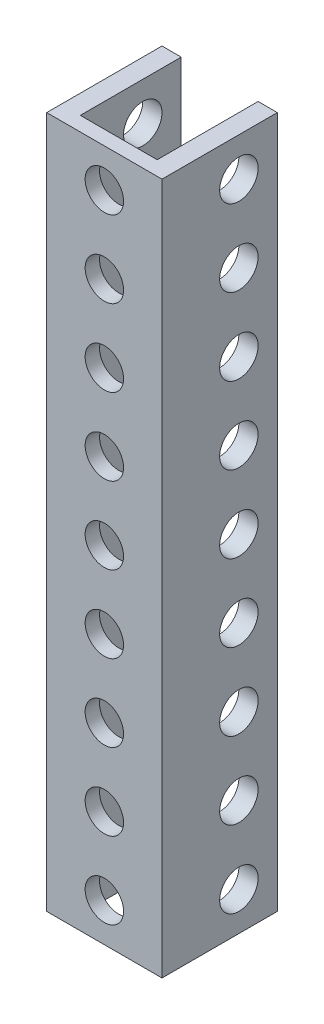
ISO-10303-21;
HEADER;
FILE_DESCRIPTION(('STEP AP214'),'2;1');
FILE_NAME('part.step','',(''),(''),'','','');
FILE_SCHEMA(('AUTOMOTIVE_DESIGN { 1 0 10303 214 1 1 1 1 }'));
ENDSEC;
DATA;
#1=APPLICATION_CONTEXT('core data for automotive mechanical design processes');
#2=APPLICATION_PROTOCOL_DEFINITION('international standard','automotive_design',2000,#1);
#3=PRODUCT_CONTEXT('',#1,'mechanical');
#4=PRODUCT('Part','Part','',(#3));
#5=PRODUCT_RELATED_PRODUCT_CATEGORY('part','',(#4));
#6=PRODUCT_DEFINITION_FORMATION('','',#4);
#7=PRODUCT_DEFINITION_CONTEXT('part definition',#1,'design');
#8=PRODUCT_DEFINITION('design','',#6,#7);
#9=PRODUCT_DEFINITION_SHAPE('','',#8);
#10=(LENGTH_UNIT() NAMED_UNIT(*) SI_UNIT(.MILLI.,.METRE.));
#11=(NAMED_UNIT(*) PLANE_ANGLE_UNIT() SI_UNIT($,.RADIAN.));
#12=(NAMED_UNIT(*) SI_UNIT($,.STERADIAN.) SOLID_ANGLE_UNIT());
#13=UNCERTAINTY_MEASURE_WITH_UNIT(LENGTH_MEASURE(1.E-05),#10,'distance_accuracy_value','');
#14=(GEOMETRIC_REPRESENTATION_CONTEXT(3) GLOBAL_UNCERTAINTY_ASSIGNED_CONTEXT((#13)) GLOBAL_UNIT_ASSIGNED_CONTEXT((#10,
#11,#12)) REPRESENTATION_CONTEXT('',''));
#15=CARTESIAN_POINT('',(0.,0.,0.));
#16=DIRECTION('',(0.,0.,1.));
#17=DIRECTION('',(1.,0.,0.));
#18=AXIS2_PLACEMENT_3D('',#15,#16,#17);
#19=CARTESIAN_POINT('',(-6.,12.,-6.5));
#20=DIRECTION('',(-1.,0.,0.));
#21=DIRECTION('',(0.,0.,1.));
#22=AXIS2_PLACEMENT_3D('',#19,#20,#21);
#23=CYLINDRICAL_SURFACE('',#22,1.99999999999999);
#24=CARTESIAN_POINT('',(4.,12.,-6.5));
#25=DIRECTION('',(-1.,0.,0.));
#26=DIRECTION('',(0.,0.,1.));
#27=AXIS2_PLACEMENT_3D('',#24,#25,#26);
#28=CIRCLE('',#27,1.99999999999999);
#29=CARTESIAN_POINT('',(4.,12.,-4.50000000000001));
#30=VERTEX_POINT('',#29);
#31=EDGE_CURVE('E128',#30,#30,#28,.T.);
#32=ORIENTED_EDGE('',*,*,#31,.T.);
#33=EDGE_LOOP('',(#32));
#34=FACE_BOUND('',#33,.T.);
#35=CARTESIAN_POINT('',(6.,12.,-6.5));
#36=DIRECTION('',(-1.,0.,0.));
#37=DIRECTION('',(0.,0.,1.));
#38=AXIS2_PLACEMENT_3D('',#35,#36,#37);
#39=CIRCLE('',#38,1.99999999999999);
#40=CARTESIAN_POINT('',(6.,12.,-4.50000000000001));
#41=VERTEX_POINT('',#40);
#42=EDGE_CURVE('E20',#41,#41,#39,.F.);
#43=ORIENTED_EDGE('',*,*,#42,.T.);
#44=EDGE_LOOP('',(#43));
#45=FACE_BOUND('',#44,.T.);
#46=ADVANCED_FACE('F17',(#34,#45),#23,.F.);
#47=CARTESIAN_POINT('',(-6.,4.,-6.5));
#48=DIRECTION('',(-1.,0.,0.));
#49=DIRECTION('',(0.,0.,1.));
#50=AXIS2_PLACEMENT_3D('',#47,#48,#49);
#51=CYLINDRICAL_SURFACE('',#50,1.99999999999999);
#52=CARTESIAN_POINT('',(4.,4.,-6.5));
#53=DIRECTION('',(-1.,0.,0.));
#54=DIRECTION('',(0.,0.,1.));
#55=AXIS2_PLACEMENT_3D('',#52,#53,#54);
#56=CIRCLE('',#55,1.99999999999999);
#57=CARTESIAN_POINT('',(4.,4.,-4.50000000000001));
#58=VERTEX_POINT('',#57);
#59=EDGE_CURVE('E125',#58,#58,#56,.T.);
#60=ORIENTED_EDGE('',*,*,#59,.T.);
#61=EDGE_LOOP('',(#60));
#62=FACE_BOUND('',#61,.T.);
#63=CARTESIAN_POINT('',(6.,4.,-6.5));
#64=DIRECTION('',(-1.,0.,0.));
#65=DIRECTION('',(0.,0.,1.));
#66=AXIS2_PLACEMENT_3D('',#63,#64,#65);
#67=CIRCLE('',#66,1.99999999999999);
#68=CARTESIAN_POINT('',(6.,4.,-4.50000000000001));
#69=VERTEX_POINT('',#68);
#70=EDGE_CURVE('E277',#69,#69,#67,.F.);
#71=ORIENTED_EDGE('',*,*,#70,.T.);
#72=EDGE_LOOP('',(#71));
#73=FACE_BOUND('',#72,.T.);
#74=ADVANCED_FACE('F392',(#62,#73),#51,.F.);
#75=CARTESIAN_POINT('',(-6.,20.,-6.5));
#76=DIRECTION('',(-1.,0.,0.));
#77=DIRECTION('',(0.,0.,1.));
#78=AXIS2_PLACEMENT_3D('',#75,#76,#77);
#79=CYLINDRICAL_SURFACE('',#78,1.99999999999999);
#80=CARTESIAN_POINT('',(4.,20.,-6.5));
#81=DIRECTION('',(-1.,0.,0.));
#82=DIRECTION('',(0.,0.,1.));
#83=AXIS2_PLACEMENT_3D('',#80,#81,#82);
#84=CIRCLE('',#83,1.99999999999999);
#85=CARTESIAN_POINT('',(4.,20.,-4.50000000000001));
#86=VERTEX_POINT('',#85);
#87=EDGE_CURVE('E124',#86,#86,#84,.T.);
#88=ORIENTED_EDGE('',*,*,#87,.T.);
#89=EDGE_LOOP('',(#88));
#90=FACE_BOUND('',#89,.T.);
#91=CARTESIAN_POINT('',(6.,20.,-6.5));
#92=DIRECTION('',(-1.,0.,0.));
#93=DIRECTION('',(0.,0.,1.));
#94=AXIS2_PLACEMENT_3D('',#91,#92,#93);
#95=CIRCLE('',#94,1.99999999999999);
#96=CARTESIAN_POINT('',(6.,20.,-4.50000000000001));
#97=VERTEX_POINT('',#96);
#98=EDGE_CURVE('E275',#97,#97,#95,.F.);
#99=ORIENTED_EDGE('',*,*,#98,.T.);
#100=EDGE_LOOP('',(#99));
#101=FACE_BOUND('',#100,.T.);
#102=ADVANCED_FACE('F395',(#90,#101),#79,.F.);
#103=CARTESIAN_POINT('',(-6.,28.,-6.5));
#104=DIRECTION('',(-1.,0.,0.));
#105=DIRECTION('',(0.,0.,1.));
#106=AXIS2_PLACEMENT_3D('',#103,#104,#105);
#107=CYLINDRICAL_SURFACE('',#106,1.99999999999999);
#108=CARTESIAN_POINT('',(4.,28.,-6.5));
#109=DIRECTION('',(-1.,0.,0.));
#110=DIRECTION('',(0.,0.,1.));
#111=AXIS2_PLACEMENT_3D('',#108,#109,#110);
#112=CIRCLE('',#111,1.99999999999999);
#113=CARTESIAN_POINT('',(4.,28.,-4.50000000000001));
#114=VERTEX_POINT('',#113);
#115=EDGE_CURVE('E249',#114,#114,#112,.T.);
#116=ORIENTED_EDGE('',*,*,#115,.T.);
#117=EDGE_LOOP('',(#116));
#118=FACE_BOUND('',#117,.T.);
#119=CARTESIAN_POINT('',(6.,28.,-6.5));
#120=DIRECTION('',(-1.,0.,0.));
#121=DIRECTION('',(0.,0.,1.));
#122=AXIS2_PLACEMENT_3D('',#119,#120,#121);
#123=CIRCLE('',#122,1.99999999999999);
#124=CARTESIAN_POINT('',(6.,28.,-4.50000000000001));
#125=VERTEX_POINT('',#124);
#126=EDGE_CURVE('E272',#125,#125,#123,.F.);
#127=ORIENTED_EDGE('',*,*,#126,.T.);
#128=EDGE_LOOP('',(#127));
#129=FACE_BOUND('',#128,.T.);
#130=ADVANCED_FACE('F400',(#118,#129),#107,.F.);
#131=CARTESIAN_POINT('',(-6.,36.,-6.5));
#132=DIRECTION('',(-1.,0.,0.));
#133=DIRECTION('',(0.,0.,1.));
#134=AXIS2_PLACEMENT_3D('',#131,#132,#133);
#135=CYLINDRICAL_SURFACE('',#134,1.99999999999999);
#136=CARTESIAN_POINT('',(4.,36.,-6.5));
#137=DIRECTION('',(-1.,0.,0.));
#138=DIRECTION('',(0.,0.,1.));
#139=AXIS2_PLACEMENT_3D('',#136,#137,#138);
#140=CIRCLE('',#139,1.99999999999999);
#141=CARTESIAN_POINT('',(4.,36.,-4.50000000000001));
#142=VERTEX_POINT('',#141);
#143=EDGE_CURVE('E246',#142,#142,#140,.T.);
#144=ORIENTED_EDGE('',*,*,#143,.T.);
#145=EDGE_LOOP('',(#144));
#146=FACE_BOUND('',#145,.T.);
#147=CARTESIAN_POINT('',(6.,36.,-6.5));
#148=DIRECTION('',(-1.,0.,0.));
#149=DIRECTION('',(0.,0.,1.));
#150=AXIS2_PLACEMENT_3D('',#147,#148,#149);
#151=CIRCLE('',#150,1.99999999999999);
#152=CARTESIAN_POINT('',(6.,36.,-4.50000000000001));
#153=VERTEX_POINT('',#152);
#154=EDGE_CURVE('E269',#153,#153,#151,.F.);
#155=ORIENTED_EDGE('',*,*,#154,.T.);
#156=EDGE_LOOP('',(#155));
#157=FACE_BOUND('',#156,.T.);
#158=ADVANCED_FACE('F406',(#146,#157),#135,.F.);
#159=CARTESIAN_POINT('',(-6.,44.,-6.5));
#160=DIRECTION('',(-1.,0.,0.));
#161=DIRECTION('',(0.,0.,1.));
#162=AXIS2_PLACEMENT_3D('',#159,#160,#161);
#163=CYLINDRICAL_SURFACE('',#162,1.99999999999999);
#164=CARTESIAN_POINT('',(4.,44.,-6.5));
#165=DIRECTION('',(-1.,0.,0.));
#166=DIRECTION('',(0.,0.,1.));
#167=AXIS2_PLACEMENT_3D('',#164,#165,#166);
#168=CIRCLE('',#167,1.99999999999999);
#169=CARTESIAN_POINT('',(4.,44.,-4.50000000000001));
#170=VERTEX_POINT('',#169);
#171=EDGE_CURVE('E243',#170,#170,#168,.T.);
#172=ORIENTED_EDGE('',*,*,#171,.T.);
#173=EDGE_LOOP('',(#172));
#174=FACE_BOUND('',#173,.T.);
#175=CARTESIAN_POINT('',(6.,44.,-6.5));
#176=DIRECTION('',(-1.,0.,0.));
#177=DIRECTION('',(0.,0.,1.));
#178=AXIS2_PLACEMENT_3D('',#175,#176,#177);
#179=CIRCLE('',#178,1.99999999999999);
#180=CARTESIAN_POINT('',(6.,44.,-4.50000000000001));
#181=VERTEX_POINT('',#180);
#182=EDGE_CURVE('E266',#181,#181,#179,.F.);
#183=ORIENTED_EDGE('',*,*,#182,.T.);
#184=EDGE_LOOP('',(#183));
#185=FACE_BOUND('',#184,.T.);
#186=ADVANCED_FACE('F410',(#174,#185),#163,.F.);
#187=CARTESIAN_POINT('',(-6.,52.,-6.5));
#188=DIRECTION('',(-1.,0.,0.));
#189=DIRECTION('',(0.,0.,1.));
#190=AXIS2_PLACEMENT_3D('',#187,#188,#189);
#191=CYLINDRICAL_SURFACE('',#190,1.99999999999999);
#192=CARTESIAN_POINT('',(4.,52.,-6.5));
#193=DIRECTION('',(-1.,0.,0.));
#194=DIRECTION('',(0.,0.,1.));
#195=AXIS2_PLACEMENT_3D('',#192,#193,#194);
#196=CIRCLE('',#195,1.99999999999999);
#197=CARTESIAN_POINT('',(4.,52.,-4.50000000000001));
#198=VERTEX_POINT('',#197);
#199=EDGE_CURVE('E240',#198,#198,#196,.T.);
#200=ORIENTED_EDGE('',*,*,#199,.T.);
#201=EDGE_LOOP('',(#200));
#202=FACE_BOUND('',#201,.T.);
#203=CARTESIAN_POINT('',(6.,52.,-6.5));
#204=DIRECTION('',(-1.,0.,0.));
#205=DIRECTION('',(0.,0.,1.));
#206=AXIS2_PLACEMENT_3D('',#203,#204,#205);
#207=CIRCLE('',#206,1.99999999999999);
#208=CARTESIAN_POINT('',(6.,52.,-4.50000000000001));
#209=VERTEX_POINT('',#208);
#210=EDGE_CURVE('E263',#209,#209,#207,.F.);
#211=ORIENTED_EDGE('',*,*,#210,.T.);
#212=EDGE_LOOP('',(#211));
#213=FACE_BOUND('',#212,.T.);
#214=ADVANCED_FACE('F414',(#202,#213),#191,.F.);
#215=CARTESIAN_POINT('',(-6.,60.,-6.5));
#216=DIRECTION('',(-1.,0.,0.));
#217=DIRECTION('',(0.,0.,1.));
#218=AXIS2_PLACEMENT_3D('',#215,#216,#217);
#219=CYLINDRICAL_SURFACE('',#218,1.99999999999999);
#220=CARTESIAN_POINT('',(4.,60.,-6.5));
#221=DIRECTION('',(-1.,0.,0.));
#222=DIRECTION('',(0.,0.,1.));
#223=AXIS2_PLACEMENT_3D('',#220,#221,#222);
#224=CIRCLE('',#223,1.99999999999999);
#225=CARTESIAN_POINT('',(4.,60.,-4.50000000000001));
#226=VERTEX_POINT('',#225);
#227=EDGE_CURVE('E237',#226,#226,#224,.T.);
#228=ORIENTED_EDGE('',*,*,#227,.T.);
#229=EDGE_LOOP('',(#228));
#230=FACE_BOUND('',#229,.T.);
#231=CARTESIAN_POINT('',(6.,60.,-6.5));
#232=DIRECTION('',(-1.,0.,0.));
#233=DIRECTION('',(0.,0.,1.));
#234=AXIS2_PLACEMENT_3D('',#231,#232,#233);
#235=CIRCLE('',#234,1.99999999999999);
#236=CARTESIAN_POINT('',(6.,60.,-4.50000000000001));
#237=VERTEX_POINT('',#236);
#238=EDGE_CURVE('E260',#237,#237,#235,.F.);
#239=ORIENTED_EDGE('',*,*,#238,.T.);
#240=EDGE_LOOP('',(#239));
#241=FACE_BOUND('',#240,.T.);
#242=ADVANCED_FACE('F418',(#230,#241),#219,.F.);
#243=CARTESIAN_POINT('',(-6.,68.,-6.5));
#244=DIRECTION('',(-1.,0.,0.));
#245=DIRECTION('',(0.,0.,1.));
#246=AXIS2_PLACEMENT_3D('',#243,#244,#245);
#247=CYLINDRICAL_SURFACE('',#246,1.99999999999999);
#248=CARTESIAN_POINT('',(4.,68.,-6.5));
#249=DIRECTION('',(-1.,0.,0.));
#250=DIRECTION('',(0.,0.,1.));
#251=AXIS2_PLACEMENT_3D('',#248,#249,#250);
#252=CIRCLE('',#251,1.99999999999999);
#253=CARTESIAN_POINT('',(4.,68.,-4.50000000000001));
#254=VERTEX_POINT('',#253);
#255=EDGE_CURVE('E234',#254,#254,#252,.T.);
#256=ORIENTED_EDGE('',*,*,#255,.T.);
#257=EDGE_LOOP('',(#256));
#258=FACE_BOUND('',#257,.T.);
#259=CARTESIAN_POINT('',(6.,68.,-6.5));
#260=DIRECTION('',(-1.,0.,0.));
#261=DIRECTION('',(0.,0.,1.));
#262=AXIS2_PLACEMENT_3D('',#259,#260,#261);
#263=CIRCLE('',#262,1.99999999999999);
#264=CARTESIAN_POINT('',(6.,68.,-4.50000000000001));
#265=VERTEX_POINT('',#264);
#266=EDGE_CURVE('E129',#265,#265,#263,.F.);
#267=ORIENTED_EDGE('',*,*,#266,.T.);
#268=EDGE_LOOP('',(#267));
#269=FACE_BOUND('',#268,.T.);
#270=ADVANCED_FACE('F422',(#258,#269),#247,.F.);
#271=CARTESIAN_POINT('',(0.,68.,1.5));
#272=DIRECTION('',(0.,0.,1.));
#273=DIRECTION('',(1.,0.,0.));
#274=AXIS2_PLACEMENT_3D('',#271,#272,#273);
#275=CYLINDRICAL_SURFACE('',#274,1.99999999999999);
#276=CARTESIAN_POINT('',(0.,68.,0.));
#277=DIRECTION('',(0.,0.,1.));
#278=DIRECTION('',(1.,0.,0.));
#279=AXIS2_PLACEMENT_3D('',#276,#277,#278);
#280=CIRCLE('',#279,1.99999999999999);
#281=CARTESIAN_POINT('',(1.99999999999999,68.,0.));
#282=VERTEX_POINT('',#281);
#283=EDGE_CURVE('E231',#282,#282,#280,.F.);
#284=ORIENTED_EDGE('',*,*,#283,.T.);
#285=EDGE_LOOP('',(#284));
#286=FACE_BOUND('',#285,.T.);
#287=CARTESIAN_POINT('',(0.,68.,1.5));
#288=DIRECTION('',(0.,0.,1.));
#289=DIRECTION('',(1.,0.,0.));
#290=AXIS2_PLACEMENT_3D('',#287,#288,#289);
#291=CIRCLE('',#290,1.99999999999999);
#292=CARTESIAN_POINT('',(1.99999999999999,68.,1.5));
#293=VERTEX_POINT('',#292);
#294=EDGE_CURVE('E201',#293,#293,#291,.T.);
#295=ORIENTED_EDGE('',*,*,#294,.T.);
#296=EDGE_LOOP('',(#295));
#297=FACE_BOUND('',#296,.T.);
#298=ADVANCED_FACE('F426',(#286,#297),#275,.F.);
#299=CARTESIAN_POINT('',(0.,60.,1.5));
#300=DIRECTION('',(0.,0.,1.));
#301=DIRECTION('',(1.,0.,0.));
#302=AXIS2_PLACEMENT_3D('',#299,#300,#301);
#303=CYLINDRICAL_SURFACE('',#302,1.99999999999999);
#304=CARTESIAN_POINT('',(0.,60.,0.));
#305=DIRECTION('',(0.,0.,1.));
#306=DIRECTION('',(1.,0.,0.));
#307=AXIS2_PLACEMENT_3D('',#304,#305,#306);
#308=CIRCLE('',#307,1.99999999999999);
#309=CARTESIAN_POINT('',(1.99999999999999,60.,0.));
#310=VERTEX_POINT('',#309);
#311=EDGE_CURVE('E228',#310,#310,#308,.F.);
#312=ORIENTED_EDGE('',*,*,#311,.T.);
#313=EDGE_LOOP('',(#312));
#314=FACE_BOUND('',#313,.T.);
#315=CARTESIAN_POINT('',(0.,60.,1.5));
#316=DIRECTION('',(0.,0.,1.));
#317=DIRECTION('',(1.,0.,0.));
#318=AXIS2_PLACEMENT_3D('',#315,#316,#317);
#319=CIRCLE('',#318,1.99999999999999);
#320=CARTESIAN_POINT('',(1.99999999999999,60.,1.5));
#321=VERTEX_POINT('',#320);
#322=EDGE_CURVE('E198',#321,#321,#319,.T.);
#323=ORIENTED_EDGE('',*,*,#322,.T.);
#324=EDGE_LOOP('',(#323));
#325=FACE_BOUND('',#324,.T.);
#326=ADVANCED_FACE('F430',(#314,#325),#303,.F.);
#327=CARTESIAN_POINT('',(0.,52.,1.5));
#328=DIRECTION('',(0.,0.,1.));
#329=DIRECTION('',(1.,0.,0.));
#330=AXIS2_PLACEMENT_3D('',#327,#328,#329);
#331=CYLINDRICAL_SURFACE('',#330,1.99999999999999);
#332=CARTESIAN_POINT('',(0.,52.,0.));
#333=DIRECTION('',(0.,0.,1.));
#334=DIRECTION('',(1.,0.,0.));
#335=AXIS2_PLACEMENT_3D('',#332,#333,#334);
#336=CIRCLE('',#335,1.99999999999999);
#337=CARTESIAN_POINT('',(1.99999999999999,52.,0.));
#338=VERTEX_POINT('',#337);
#339=EDGE_CURVE('E225',#338,#338,#336,.F.);
#340=ORIENTED_EDGE('',*,*,#339,.T.);
#341=EDGE_LOOP('',(#340));
#342=FACE_BOUND('',#341,.T.);
#343=CARTESIAN_POINT('',(0.,52.,1.5));
#344=DIRECTION('',(0.,0.,1.));
#345=DIRECTION('',(1.,0.,0.));
#346=AXIS2_PLACEMENT_3D('',#343,#344,#345);
#347=CIRCLE('',#346,1.99999999999999);
#348=CARTESIAN_POINT('',(1.99999999999999,52.,1.5));
#349=VERTEX_POINT('',#348);
#350=EDGE_CURVE('E195',#349,#349,#347,.T.);
#351=ORIENTED_EDGE('',*,*,#350,.T.);
#352=EDGE_LOOP('',(#351));
#353=FACE_BOUND('',#352,.T.);
#354=ADVANCED_FACE('F434',(#342,#353),#331,.F.);
#355=CARTESIAN_POINT('',(0.,44.,1.5));
#356=DIRECTION('',(0.,0.,1.));
#357=DIRECTION('',(1.,0.,0.));
#358=AXIS2_PLACEMENT_3D('',#355,#356,#357);
#359=CYLINDRICAL_SURFACE('',#358,1.99999999999999);
#360=CARTESIAN_POINT('',(0.,44.,0.));
#361=DIRECTION('',(0.,0.,1.));
#362=DIRECTION('',(1.,0.,0.));
#363=AXIS2_PLACEMENT_3D('',#360,#361,#362);
#364=CIRCLE('',#363,1.99999999999999);
#365=CARTESIAN_POINT('',(1.99999999999999,44.,0.));
#366=VERTEX_POINT('',#365);
#367=EDGE_CURVE('E222',#366,#366,#364,.F.);
#368=ORIENTED_EDGE('',*,*,#367,.T.);
#369=EDGE_LOOP('',(#368));
#370=FACE_BOUND('',#369,.T.);
#371=CARTESIAN_POINT('',(0.,44.,1.5));
#372=DIRECTION('',(0.,0.,1.));
#373=DIRECTION('',(1.,0.,0.));
#374=AXIS2_PLACEMENT_3D('',#371,#372,#373);
#375=CIRCLE('',#374,1.99999999999999);
#376=CARTESIAN_POINT('',(1.99999999999999,44.,1.5));
#377=VERTEX_POINT('',#376);
#378=EDGE_CURVE('E192',#377,#377,#375,.T.);
#379=ORIENTED_EDGE('',*,*,#378,.T.);
#380=EDGE_LOOP('',(#379));
#381=FACE_BOUND('',#380,.T.);
#382=ADVANCED_FACE('F438',(#370,#381),#359,.F.);
#383=CARTESIAN_POINT('',(0.,36.,1.5));
#384=DIRECTION('',(0.,0.,1.));
#385=DIRECTION('',(1.,0.,0.));
#386=AXIS2_PLACEMENT_3D('',#383,#384,#385);
#387=CYLINDRICAL_SURFACE('',#386,1.99999999999999);
#388=CARTESIAN_POINT('',(0.,36.,0.));
#389=DIRECTION('',(0.,0.,1.));
#390=DIRECTION('',(1.,0.,0.));
#391=AXIS2_PLACEMENT_3D('',#388,#389,#390);
#392=CIRCLE('',#391,1.99999999999999);
#393=CARTESIAN_POINT('',(1.99999999999999,36.,0.));
#394=VERTEX_POINT('',#393);
#395=EDGE_CURVE('E219',#394,#394,#392,.F.);
#396=ORIENTED_EDGE('',*,*,#395,.T.);
#397=EDGE_LOOP('',(#396));
#398=FACE_BOUND('',#397,.T.);
#399=CARTESIAN_POINT('',(0.,36.,1.5));
#400=DIRECTION('',(0.,0.,1.));
#401=DIRECTION('',(1.,0.,0.));
#402=AXIS2_PLACEMENT_3D('',#399,#400,#401);
#403=CIRCLE('',#402,1.99999999999999);
#404=CARTESIAN_POINT('',(1.99999999999999,36.,1.5));
#405=VERTEX_POINT('',#404);
#406=EDGE_CURVE('E189',#405,#405,#403,.T.);
#407=ORIENTED_EDGE('',*,*,#406,.T.);
#408=EDGE_LOOP('',(#407));
#409=FACE_BOUND('',#408,.T.);
#410=ADVANCED_FACE('F442',(#398,#409),#387,.F.);
#411=CARTESIAN_POINT('',(0.,28.,1.5));
#412=DIRECTION('',(0.,0.,1.));
#413=DIRECTION('',(1.,0.,0.));
#414=AXIS2_PLACEMENT_3D('',#411,#412,#413);
#415=CYLINDRICAL_SURFACE('',#414,1.99999999999999);
#416=CARTESIAN_POINT('',(0.,28.,0.));
#417=DIRECTION('',(0.,0.,1.));
#418=DIRECTION('',(1.,0.,0.));
#419=AXIS2_PLACEMENT_3D('',#416,#417,#418);
#420=CIRCLE('',#419,1.99999999999999);
#421=CARTESIAN_POINT('',(1.99999999999999,28.,0.));
#422=VERTEX_POINT('',#421);
#423=EDGE_CURVE('E216',#422,#422,#420,.F.);
#424=ORIENTED_EDGE('',*,*,#423,.T.);
#425=EDGE_LOOP('',(#424));
#426=FACE_BOUND('',#425,.T.);
#427=CARTESIAN_POINT('',(0.,28.,1.5));
#428=DIRECTION('',(0.,0.,1.));
#429=DIRECTION('',(1.,0.,0.));
#430=AXIS2_PLACEMENT_3D('',#427,#428,#429);
#431=CIRCLE('',#430,1.99999999999999);
#432=CARTESIAN_POINT('',(1.99999999999999,28.,1.5));
#433=VERTEX_POINT('',#432);
#434=EDGE_CURVE('E186',#433,#433,#431,.T.);
#435=ORIENTED_EDGE('',*,*,#434,.T.);
#436=EDGE_LOOP('',(#435));
#437=FACE_BOUND('',#436,.T.);
#438=ADVANCED_FACE('F446',(#426,#437),#415,.F.);
#439=CARTESIAN_POINT('',(0.,20.,1.5));
#440=DIRECTION('',(0.,0.,1.));
#441=DIRECTION('',(1.,0.,0.));
#442=AXIS2_PLACEMENT_3D('',#439,#440,#441);
#443=CYLINDRICAL_SURFACE('',#442,1.99999999999999);
#444=CARTESIAN_POINT('',(0.,20.,0.));
#445=DIRECTION('',(0.,0.,1.));
#446=DIRECTION('',(1.,0.,0.));
#447=AXIS2_PLACEMENT_3D('',#444,#445,#446);
#448=CIRCLE('',#447,1.99999999999999);
#449=CARTESIAN_POINT('',(1.99999999999999,20.,0.));
#450=VERTEX_POINT('',#449);
#451=EDGE_CURVE('E213',#450,#450,#448,.F.);
#452=ORIENTED_EDGE('',*,*,#451,.T.);
#453=EDGE_LOOP('',(#452));
#454=FACE_BOUND('',#453,.T.);
#455=CARTESIAN_POINT('',(0.,20.,1.5));
#456=DIRECTION('',(0.,0.,1.));
#457=DIRECTION('',(1.,0.,0.));
#458=AXIS2_PLACEMENT_3D('',#455,#456,#457);
#459=CIRCLE('',#458,1.99999999999999);
#460=CARTESIAN_POINT('',(1.99999999999999,20.,1.5));
#461=VERTEX_POINT('',#460);
#462=EDGE_CURVE('E183',#461,#461,#459,.T.);
#463=ORIENTED_EDGE('',*,*,#462,.T.);
#464=EDGE_LOOP('',(#463));
#465=FACE_BOUND('',#464,.T.);
#466=ADVANCED_FACE('F450',(#454,#465),#443,.F.);
#467=CARTESIAN_POINT('',(0.,12.,1.5));
#468=DIRECTION('',(0.,0.,1.));
#469=DIRECTION('',(1.,0.,0.));
#470=AXIS2_PLACEMENT_3D('',#467,#468,#469);
#471=CYLINDRICAL_SURFACE('',#470,1.99999999999999);
#472=CARTESIAN_POINT('',(0.,12.,0.));
#473=DIRECTION('',(0.,0.,1.));
#474=DIRECTION('',(1.,0.,0.));
#475=AXIS2_PLACEMENT_3D('',#472,#473,#474);
#476=CIRCLE('',#475,1.99999999999999);
#477=CARTESIAN_POINT('',(1.99999999999999,12.,0.));
#478=VERTEX_POINT('',#477);
#479=EDGE_CURVE('E210',#478,#478,#476,.F.);
#480=ORIENTED_EDGE('',*,*,#479,.T.);
#481=EDGE_LOOP('',(#480));
#482=FACE_BOUND('',#481,.T.);
#483=CARTESIAN_POINT('',(0.,12.,1.5));
#484=DIRECTION('',(0.,0.,1.));
#485=DIRECTION('',(1.,0.,0.));
#486=AXIS2_PLACEMENT_3D('',#483,#484,#485);
#487=CIRCLE('',#486,1.99999999999999);
#488=CARTESIAN_POINT('',(1.99999999999999,12.,1.5));
#489=VERTEX_POINT('',#488);
#490=EDGE_CURVE('E180',#489,#489,#487,.T.);
#491=ORIENTED_EDGE('',*,*,#490,.T.);
#492=EDGE_LOOP('',(#491));
#493=FACE_BOUND('',#492,.T.);
#494=ADVANCED_FACE('F299',(#482,#493),#471,.F.);
#495=CARTESIAN_POINT('',(0.,4.,1.5));
#496=DIRECTION('',(0.,0.,1.));
#497=DIRECTION('',(1.,0.,0.));
#498=AXIS2_PLACEMENT_3D('',#495,#496,#497);
#499=CYLINDRICAL_SURFACE('',#498,1.99999999999999);
#500=CARTESIAN_POINT('',(0.,4.,0.));
#501=DIRECTION('',(0.,0.,1.));
#502=DIRECTION('',(1.,0.,0.));
#503=AXIS2_PLACEMENT_3D('',#500,#501,#502);
#504=CIRCLE('',#503,1.99999999999999);
#505=CARTESIAN_POINT('',(1.99999999999999,4.,0.));
#506=VERTEX_POINT('',#505);
#507=EDGE_CURVE('E120',#506,#506,#504,.F.);
#508=ORIENTED_EDGE('',*,*,#507,.T.);
#509=EDGE_LOOP('',(#508));
#510=FACE_BOUND('',#509,.T.);
#511=CARTESIAN_POINT('',(0.,4.,1.5));
#512=DIRECTION('',(0.,0.,1.));
#513=DIRECTION('',(1.,0.,0.));
#514=AXIS2_PLACEMENT_3D('',#511,#512,#513);
#515=CIRCLE('',#514,1.99999999999999);
#516=CARTESIAN_POINT('',(1.99999999999999,4.,1.5));
#517=VERTEX_POINT('',#516);
#518=EDGE_CURVE('E176',#517,#517,#515,.T.);
#519=ORIENTED_EDGE('',*,*,#518,.T.);
#520=EDGE_LOOP('',(#519));
#521=FACE_BOUND('',#520,.T.);
#522=ADVANCED_FACE('F288',(#510,#521),#499,.F.);
#523=CARTESIAN_POINT('',(6.,8.,-10.5));
#524=DIRECTION('',(-1.,0.,0.));
#525=DIRECTION('',(0.,0.,1.));
#526=AXIS2_PLACEMENT_3D('',#523,#524,#525);
#527=PLANE('',#526);
#528=ORIENTED_EDGE('',*,*,#266,.F.);
#529=EDGE_LOOP('',(#528));
#530=FACE_BOUND('',#529,.T.);
#531=ORIENTED_EDGE('',*,*,#238,.F.);
#532=EDGE_LOOP('',(#531));
#533=FACE_BOUND('',#532,.T.);
#534=ORIENTED_EDGE('',*,*,#210,.F.);
#535=EDGE_LOOP('',(#534));
#536=FACE_BOUND('',#535,.T.);
#537=ORIENTED_EDGE('',*,*,#182,.F.);
#538=EDGE_LOOP('',(#537));
#539=FACE_BOUND('',#538,.T.);
#540=ORIENTED_EDGE('',*,*,#154,.F.);
#541=EDGE_LOOP('',(#540));
#542=FACE_BOUND('',#541,.T.);
#543=ORIENTED_EDGE('',*,*,#126,.F.);
#544=EDGE_LOOP('',(#543));
#545=FACE_BOUND('',#544,.T.);
#546=ORIENTED_EDGE('',*,*,#98,.F.);
#547=EDGE_LOOP('',(#546));
#548=FACE_BOUND('',#547,.T.);
#549=DIRECTION('',(0.,1.,0.));
#550=VECTOR('',#549,1.);
#551=CARTESIAN_POINT('',(6.,8.,-10.5));
#552=LINE('',#551,#550);
#553=CARTESIAN_POINT('',(6.,0.,-10.5));
#554=VERTEX_POINT('',#553);
#555=CARTESIAN_POINT('',(6.,72.,-10.5));
#556=VERTEX_POINT('',#555);
#557=EDGE_CURVE('E126',#554,#556,#552,.T.);
#558=ORIENTED_EDGE('',*,*,#557,.T.);
#559=DIRECTION('',(0.,0.,1.));
#560=VECTOR('',#559,1.);
#561=CARTESIAN_POINT('',(6.,72.,0.));
#562=LINE('',#561,#560);
#563=CARTESIAN_POINT('',(6.,72.,1.5));
#564=VERTEX_POINT('',#563);
#565=EDGE_CURVE('E109',#564,#556,#562,.F.);
#566=ORIENTED_EDGE('',*,*,#565,.F.);
#567=DIRECTION('',(0.,1.,0.));
#568=VECTOR('',#567,1.);
#569=CARTESIAN_POINT('',(6.,8.,1.5));
#570=LINE('',#569,#568);
#571=CARTESIAN_POINT('',(6.,0.,1.5));
#572=VERTEX_POINT('',#571);
#573=EDGE_CURVE('E747',#564,#572,#570,.F.);
#574=ORIENTED_EDGE('',*,*,#573,.T.);
#575=DIRECTION('',(0.,0.,1.));
#576=VECTOR('',#575,1.);
#577=CARTESIAN_POINT('',(6.,0.,0.));
#578=LINE('',#577,#576);
#579=EDGE_CURVE('E738',#572,#554,#578,.F.);
#580=ORIENTED_EDGE('',*,*,#579,.T.);
#581=EDGE_LOOP('',(#558,#566,#574,#580));
#582=FACE_BOUND('',#581,.T.);
#583=ORIENTED_EDGE('',*,*,#70,.F.);
#584=EDGE_LOOP('',(#583));
#585=FACE_BOUND('',#584,.T.);
#586=ORIENTED_EDGE('',*,*,#42,.F.);
#587=EDGE_LOOP('',(#586));
#588=FACE_BOUND('',#587,.T.);
#589=ADVANCED_FACE('F285',(#530,#533,#536,#539,#542,#545,#548,#582,#585,#588),#527,.F.);
#590=CARTESIAN_POINT('',(4.,8.,-10.5));
#591=DIRECTION('',(0.,0.,1.));
#592=DIRECTION('',(1.,0.,0.));
#593=AXIS2_PLACEMENT_3D('',#590,#591,#592);
#594=PLANE('',#593);
#595=DIRECTION('',(0.,1.,0.));
#596=VECTOR('',#595,1.);
#597=CARTESIAN_POINT('',(4.,8.,-10.5));
#598=LINE('',#597,#596);
#599=CARTESIAN_POINT('',(4.,0.,-10.5));
#600=VERTEX_POINT('',#599);
#601=CARTESIAN_POINT('',(4.,72.,-10.5));
#602=VERTEX_POINT('',#601);
#603=EDGE_CURVE('E121',#600,#602,#598,.T.);
#604=ORIENTED_EDGE('',*,*,#603,.T.);
#605=DIRECTION('',(1.,0.,0.));
#606=VECTOR('',#605,1.);
#607=CARTESIAN_POINT('',(0.,72.,-10.5));
#608=LINE('',#607,#606);
#609=EDGE_CURVE('E111',#556,#602,#608,.F.);
#610=ORIENTED_EDGE('',*,*,#609,.F.);
#611=ORIENTED_EDGE('',*,*,#557,.F.);
#612=DIRECTION('',(1.,0.,0.));
#613=VECTOR('',#612,1.);
#614=CARTESIAN_POINT('',(0.,0.,-10.5));
#615=LINE('',#614,#613);
#616=EDGE_CURVE('E753',#554,#600,#615,.F.);
#617=ORIENTED_EDGE('',*,*,#616,.T.);
#618=EDGE_LOOP('',(#604,#610,#611,#617));
#619=FACE_BOUND('',#618,.T.);
#620=ADVANCED_FACE('F287',(#619),#594,.F.);
#621=CARTESIAN_POINT('',(4.,8.,0.));
#622=DIRECTION('',(1.,0.,0.));
#623=DIRECTION('',(0.,0.,-1.));
#624=AXIS2_PLACEMENT_3D('',#621,#622,#623);
#625=PLANE('',#624);
#626=ORIENTED_EDGE('',*,*,#255,.F.);
#627=EDGE_LOOP('',(#626));
#628=FACE_BOUND('',#627,.T.);
#629=ORIENTED_EDGE('',*,*,#227,.F.);
#630=EDGE_LOOP('',(#629));
#631=FACE_BOUND('',#630,.T.);
#632=ORIENTED_EDGE('',*,*,#199,.F.);
#633=EDGE_LOOP('',(#632));
#634=FACE_BOUND('',#633,.T.);
#635=ORIENTED_EDGE('',*,*,#171,.F.);
#636=EDGE_LOOP('',(#635));
#637=FACE_BOUND('',#636,.T.);
#638=ORIENTED_EDGE('',*,*,#143,.F.);
#639=EDGE_LOOP('',(#638));
#640=FACE_BOUND('',#639,.T.);
#641=ORIENTED_EDGE('',*,*,#115,.F.);
#642=EDGE_LOOP('',(#641));
#643=FACE_BOUND('',#642,.T.);
#644=ORIENTED_EDGE('',*,*,#87,.F.);
#645=EDGE_LOOP('',(#644));
#646=FACE_BOUND('',#645,.T.);
#647=DIRECTION('',(0.,1.,0.));
#648=VECTOR('',#647,1.);
#649=CARTESIAN_POINT('',(4.,8.,0.));
#650=LINE('',#649,#648);
#651=CARTESIAN_POINT('',(4.,0.,0.));
#652=VERTEX_POINT('',#651);
#653=CARTESIAN_POINT('',(4.,72.,0.));
#654=VERTEX_POINT('',#653);
#655=EDGE_CURVE('E117',#652,#654,#650,.T.);
#656=ORIENTED_EDGE('',*,*,#655,.T.);
#657=DIRECTION('',(0.,0.,1.));
#658=VECTOR('',#657,1.);
#659=CARTESIAN_POINT('',(4.,72.,0.));
#660=LINE('',#659,#658);
#661=EDGE_CURVE('E741',#602,#654,#660,.T.);
#662=ORIENTED_EDGE('',*,*,#661,.F.);
#663=ORIENTED_EDGE('',*,*,#603,.F.);
#664=DIRECTION('',(0.,0.,1.));
#665=VECTOR('',#664,1.);
#666=CARTESIAN_POINT('',(4.,0.,0.));
#667=LINE('',#666,#665);
#668=EDGE_CURVE('E755',#600,#652,#667,.T.);
#669=ORIENTED_EDGE('',*,*,#668,.T.);
#670=EDGE_LOOP('',(#656,#662,#663,#669));
#671=FACE_BOUND('',#670,.T.);
#672=ORIENTED_EDGE('',*,*,#59,.F.);
#673=EDGE_LOOP('',(#672));
#674=FACE_BOUND('',#673,.T.);
#675=ORIENTED_EDGE('',*,*,#31,.F.);
#676=EDGE_LOOP('',(#675));
#677=FACE_BOUND('',#676,.T.);
#678=ADVANCED_FACE('F296',(#628,#631,#634,#637,#640,#643,#646,#671,#674,#677),#625,.F.);
#679=CARTESIAN_POINT('',(4.,8.,0.));
#680=DIRECTION('',(0.,0.,1.));
#681=DIRECTION('',(1.,0.,0.));
#682=AXIS2_PLACEMENT_3D('',#679,#680,#681);
#683=PLANE('',#682);
#684=DIRECTION('',(0.,1.,0.));
#685=VECTOR('',#684,1.);
#686=CARTESIAN_POINT('',(-4.,8.,0.));
#687=LINE('',#686,#685);
#688=CARTESIAN_POINT('',(-4.,0.,0.));
#689=VERTEX_POINT('',#688);
#690=CARTESIAN_POINT('',(-4.,72.,0.));
#691=VERTEX_POINT('',#690);
#692=EDGE_CURVE('E80',#689,#691,#687,.T.);
#693=ORIENTED_EDGE('',*,*,#692,.T.);
#694=DIRECTION('',(1.,0.,0.));
#695=VECTOR('',#694,1.);
#696=CARTESIAN_POINT('',(0.,72.,0.));
#697=LINE('',#696,#695);
#698=EDGE_CURVE('E92',#654,#691,#697,.F.);
#699=ORIENTED_EDGE('',*,*,#698,.F.);
#700=ORIENTED_EDGE('',*,*,#655,.F.);
#701=DIRECTION('',(1.,0.,0.));
#702=VECTOR('',#701,1.);
#703=CARTESIAN_POINT('',(0.,0.,0.));
#704=LINE('',#703,#702);
#705=EDGE_CURVE('E757',#652,#689,#704,.F.);
#706=ORIENTED_EDGE('',*,*,#705,.T.);
#707=EDGE_LOOP('',(#693,#699,#700,#706));
#708=FACE_BOUND('',#707,.T.);
#709=ORIENTED_EDGE('',*,*,#507,.F.);
#710=EDGE_LOOP('',(#709));
#711=FACE_BOUND('',#710,.T.);
#712=ORIENTED_EDGE('',*,*,#479,.F.);
#713=EDGE_LOOP('',(#712));
#714=FACE_BOUND('',#713,.T.);
#715=ORIENTED_EDGE('',*,*,#451,.F.);
#716=EDGE_LOOP('',(#715));
#717=FACE_BOUND('',#716,.T.);
#718=ORIENTED_EDGE('',*,*,#423,.F.);
#719=EDGE_LOOP('',(#718));
#720=FACE_BOUND('',#719,.T.);
#721=ORIENTED_EDGE('',*,*,#395,.F.);
#722=EDGE_LOOP('',(#721));
#723=FACE_BOUND('',#722,.T.);
#724=ORIENTED_EDGE('',*,*,#367,.F.);
#725=EDGE_LOOP('',(#724));
#726=FACE_BOUND('',#725,.T.);
#727=ORIENTED_EDGE('',*,*,#339,.F.);
#728=EDGE_LOOP('',(#727));
#729=FACE_BOUND('',#728,.T.);
#730=ORIENTED_EDGE('',*,*,#311,.F.);
#731=EDGE_LOOP('',(#730));
#732=FACE_BOUND('',#731,.T.);
#733=ORIENTED_EDGE('',*,*,#283,.F.);
#734=EDGE_LOOP('',(#733));
#735=FACE_BOUND('',#734,.T.);
#736=ADVANCED_FACE('F362',(#708,#711,#714,#717,#720,#723,#726,#729,#732,#735),#683,.F.);
#737=CARTESIAN_POINT('',(-4.,8.,0.));
#738=DIRECTION('',(-1.,0.,0.));
#739=DIRECTION('',(0.,0.,1.));
#740=AXIS2_PLACEMENT_3D('',#737,#738,#739);
#741=PLANE('',#740);
#742=CARTESIAN_POINT('',(-4.,68.,-6.5));
#743=DIRECTION('',(-1.,0.,0.));
#744=DIRECTION('',(0.,0.,1.));
#745=AXIS2_PLACEMENT_3D('',#742,#743,#744);
#746=CIRCLE('',#745,1.99999999999999);
#747=CARTESIAN_POINT('',(-4.,68.,-4.5));
#748=VERTEX_POINT('',#747);
#749=EDGE_CURVE('E155',#748,#748,#746,.T.);
#750=ORIENTED_EDGE('',*,*,#749,.T.);
#751=EDGE_LOOP('',(#750));
#752=FACE_BOUND('',#751,.T.);
#753=CARTESIAN_POINT('',(-4.,60.,-6.5));
#754=DIRECTION('',(-1.,0.,0.));
#755=DIRECTION('',(0.,0.,1.));
#756=AXIS2_PLACEMENT_3D('',#753,#754,#755);
#757=CIRCLE('',#756,1.99999999999999);
#758=CARTESIAN_POINT('',(-4.,60.,-4.5));
#759=VERTEX_POINT('',#758);
#760=EDGE_CURVE('E158',#759,#759,#757,.T.);
#761=ORIENTED_EDGE('',*,*,#760,.T.);
#762=EDGE_LOOP('',(#761));
#763=FACE_BOUND('',#762,.T.);
#764=CARTESIAN_POINT('',(-4.,52.,-6.5));
#765=DIRECTION('',(-1.,0.,0.));
#766=DIRECTION('',(0.,0.,1.));
#767=AXIS2_PLACEMENT_3D('',#764,#765,#766);
#768=CIRCLE('',#767,1.99999999999999);
#769=CARTESIAN_POINT('',(-4.,52.,-4.5));
#770=VERTEX_POINT('',#769);
#771=EDGE_CURVE('E161',#770,#770,#768,.T.);
#772=ORIENTED_EDGE('',*,*,#771,.T.);
#773=EDGE_LOOP('',(#772));
#774=FACE_BOUND('',#773,.T.);
#775=CARTESIAN_POINT('',(-4.,44.,-6.5));
#776=DIRECTION('',(-1.,0.,0.));
#777=DIRECTION('',(0.,0.,1.));
#778=AXIS2_PLACEMENT_3D('',#775,#776,#777);
#779=CIRCLE('',#778,1.99999999999999);
#780=CARTESIAN_POINT('',(-4.,44.,-4.5));
#781=VERTEX_POINT('',#780);
#782=EDGE_CURVE('E164',#781,#781,#779,.T.);
#783=ORIENTED_EDGE('',*,*,#782,.T.);
#784=EDGE_LOOP('',(#783));
#785=FACE_BOUND('',#784,.T.);
#786=CARTESIAN_POINT('',(-4.,36.,-6.5));
#787=DIRECTION('',(-1.,0.,0.));
#788=DIRECTION('',(0.,0.,1.));
#789=AXIS2_PLACEMENT_3D('',#786,#787,#788);
#790=CIRCLE('',#789,1.99999999999999);
#791=CARTESIAN_POINT('',(-4.,36.,-4.5));
#792=VERTEX_POINT('',#791);
#793=EDGE_CURVE('E167',#792,#792,#790,.T.);
#794=ORIENTED_EDGE('',*,*,#793,.T.);
#795=EDGE_LOOP('',(#794));
#796=FACE_BOUND('',#795,.T.);
#797=CARTESIAN_POINT('',(-4.,28.,-6.5));
#798=DIRECTION('',(-1.,0.,0.));
#799=DIRECTION('',(0.,0.,1.));
#800=AXIS2_PLACEMENT_3D('',#797,#798,#799);
#801=CIRCLE('',#800,1.99999999999999);
#802=CARTESIAN_POINT('',(-4.,28.,-4.5));
#803=VERTEX_POINT('',#802);
#804=EDGE_CURVE('E170',#803,#803,#801,.T.);
#805=ORIENTED_EDGE('',*,*,#804,.T.);
#806=EDGE_LOOP('',(#805));
#807=FACE_BOUND('',#806,.T.);
#808=CARTESIAN_POINT('',(-4.,20.,-6.5));
#809=DIRECTION('',(-1.,0.,0.));
#810=DIRECTION('',(0.,0.,1.));
#811=AXIS2_PLACEMENT_3D('',#808,#809,#810);
#812=CIRCLE('',#811,1.99999999999999);
#813=CARTESIAN_POINT('',(-4.,20.,-4.5));
#814=VERTEX_POINT('',#813);
#815=EDGE_CURVE('E173',#814,#814,#812,.T.);
#816=ORIENTED_EDGE('',*,*,#815,.T.);
#817=EDGE_LOOP('',(#816));
#818=FACE_BOUND('',#817,.T.);
#819=DIRECTION('',(0.,1.,0.));
#820=VECTOR('',#819,1.);
#821=CARTESIAN_POINT('',(-4.,8.,-10.5));
#822=LINE('',#821,#820);
#823=CARTESIAN_POINT('',(-4.,0.,-10.5));
#824=VERTEX_POINT('',#823);
#825=CARTESIAN_POINT('',(-4.,72.,-10.5));
#826=VERTEX_POINT('',#825);
#827=EDGE_CURVE('E94',#824,#826,#822,.T.);
#828=ORIENTED_EDGE('',*,*,#827,.T.);
#829=DIRECTION('',(0.,0.,1.));
#830=VECTOR('',#829,1.);
#831=CARTESIAN_POINT('',(-4.,72.,0.));
#832=LINE('',#831,#830);
#833=EDGE_CURVE('E85',#691,#826,#832,.F.);
#834=ORIENTED_EDGE('',*,*,#833,.F.);
#835=ORIENTED_EDGE('',*,*,#692,.F.);
#836=DIRECTION('',(0.,0.,1.));
#837=VECTOR('',#836,1.);
#838=CARTESIAN_POINT('',(-4.,0.,0.));
#839=LINE('',#838,#837);
#840=EDGE_CURVE('E100',#689,#824,#839,.F.);
#841=ORIENTED_EDGE('',*,*,#840,.T.);
#842=EDGE_LOOP('',(#828,#834,#835,#841));
#843=FACE_BOUND('',#842,.T.);
#844=CARTESIAN_POINT('',(-4.,4.,-6.5));
#845=DIRECTION('',(-1.,0.,0.));
#846=DIRECTION('',(0.,0.,1.));
#847=AXIS2_PLACEMENT_3D('',#844,#845,#846);
#848=CIRCLE('',#847,1.99999999999999);
#849=CARTESIAN_POINT('',(-4.,4.,-4.5));
#850=VERTEX_POINT('',#849);
#851=EDGE_CURVE('E104',#850,#850,#848,.T.);
#852=ORIENTED_EDGE('',*,*,#851,.T.);
#853=EDGE_LOOP('',(#852));
#854=FACE_BOUND('',#853,.T.);
#855=CARTESIAN_POINT('',(-4.,12.,-6.5));
#856=DIRECTION('',(-1.,0.,0.));
#857=DIRECTION('',(0.,0.,1.));
#858=AXIS2_PLACEMENT_3D('',#855,#856,#857);
#859=CIRCLE('',#858,1.99999999999999);
#860=CARTESIAN_POINT('',(-4.,12.,-4.5));
#861=VERTEX_POINT('',#860);
#862=EDGE_CURVE('E116',#861,#861,#859,.T.);
#863=ORIENTED_EDGE('',*,*,#862,.T.);
#864=EDGE_LOOP('',(#863));
#865=FACE_BOUND('',#864,.T.);
#866=ADVANCED_FACE('F97',(#752,#763,#774,#785,#796,#807,#818,#843,#854,#865),#741,.F.);
#867=CARTESIAN_POINT('',(-6.,12.,-6.5));
#868=DIRECTION('',(-1.,0.,0.));
#869=DIRECTION('',(0.,0.,1.));
#870=AXIS2_PLACEMENT_3D('',#867,#868,#869);
#871=CYLINDRICAL_SURFACE('',#870,1.99999999999999);
#872=ORIENTED_EDGE('',*,*,#862,.F.);
#873=EDGE_LOOP('',(#872));
#874=FACE_BOUND('',#873,.T.);
#875=CARTESIAN_POINT('',(-6.,12.,-6.5));
#876=DIRECTION('',(-1.,0.,0.));
#877=DIRECTION('',(0.,0.,1.));
#878=AXIS2_PLACEMENT_3D('',#875,#876,#877);
#879=CIRCLE('',#878,1.99999999999999);
#880=CARTESIAN_POINT('',(-6.,12.,-4.5));
#881=VERTEX_POINT('',#880);
#882=EDGE_CURVE('E152',#881,#881,#879,.T.);
#883=ORIENTED_EDGE('',*,*,#882,.T.);
#884=EDGE_LOOP('',(#883));
#885=FACE_BOUND('',#884,.T.);
#886=ADVANCED_FACE('F355',(#874,#885),#871,.F.);
#887=CARTESIAN_POINT('',(-6.,4.,-6.5));
#888=DIRECTION('',(-1.,0.,0.));
#889=DIRECTION('',(0.,0.,1.));
#890=AXIS2_PLACEMENT_3D('',#887,#888,#889);
#891=CYLINDRICAL_SURFACE('',#890,1.99999999999999);
#892=ORIENTED_EDGE('',*,*,#851,.F.);
#893=EDGE_LOOP('',(#892));
#894=FACE_BOUND('',#893,.T.);
#895=CARTESIAN_POINT('',(-6.,4.,-6.5));
#896=DIRECTION('',(-1.,0.,0.));
#897=DIRECTION('',(0.,0.,1.));
#898=AXIS2_PLACEMENT_3D('',#895,#896,#897);
#899=CIRCLE('',#898,1.99999999999999);
#900=CARTESIAN_POINT('',(-6.,4.,-4.5));
#901=VERTEX_POINT('',#900);
#902=EDGE_CURVE('E149',#901,#901,#899,.T.);
#903=ORIENTED_EDGE('',*,*,#902,.T.);
#904=EDGE_LOOP('',(#903));
#905=FACE_BOUND('',#904,.T.);
#906=ADVANCED_FACE('F352',(#894,#905),#891,.F.);
#907=CARTESIAN_POINT('',(-4.,8.,-10.5));
#908=DIRECTION('',(0.,0.,1.));
#909=DIRECTION('',(1.,0.,0.));
#910=AXIS2_PLACEMENT_3D('',#907,#908,#909);
#911=PLANE('',#910);
#912=DIRECTION('',(0.,1.,0.));
#913=VECTOR('',#912,1.);
#914=CARTESIAN_POINT('',(-6.,8.,-10.5));
#915=LINE('',#914,#913);
#916=CARTESIAN_POINT('',(-6.,0.,-10.5));
#917=VERTEX_POINT('',#916);
#918=CARTESIAN_POINT('',(-6.,72.,-10.5));
#919=VERTEX_POINT('',#918);
#920=EDGE_CURVE('E108',#917,#919,#915,.T.);
#921=ORIENTED_EDGE('',*,*,#920,.T.);
#922=DIRECTION('',(1.,0.,0.));
#923=VECTOR('',#922,1.);
#924=CARTESIAN_POINT('',(0.,72.,-10.5));
#925=LINE('',#924,#923);
#926=EDGE_CURVE('E90',#826,#919,#925,.F.);
#927=ORIENTED_EDGE('',*,*,#926,.F.);
#928=ORIENTED_EDGE('',*,*,#827,.F.);
#929=DIRECTION('',(1.,0.,0.));
#930=VECTOR('',#929,1.);
#931=CARTESIAN_POINT('',(0.,0.,-10.5));
#932=LINE('',#931,#930);
#933=EDGE_CURVE('E749',#824,#917,#932,.F.);
#934=ORIENTED_EDGE('',*,*,#933,.T.);
#935=EDGE_LOOP('',(#921,#927,#928,#934));
#936=FACE_BOUND('',#935,.T.);
#937=ADVANCED_FACE('F107',(#936),#911,.F.);
#938=CARTESIAN_POINT('',(0.,72.,0.));
#939=DIRECTION('',(0.,1.,0.));
#940=DIRECTION('',(0.,0.,1.));
#941=AXIS2_PLACEMENT_3D('',#938,#939,#940);
#942=PLANE('',#941);
#943=ORIENTED_EDGE('',*,*,#661,.T.);
#944=ORIENTED_EDGE('',*,*,#698,.T.);
#945=ORIENTED_EDGE('',*,*,#833,.T.);
#946=ORIENTED_EDGE('',*,*,#926,.T.);
#947=DIRECTION('',(0.,0.,-1.));
#948=VECTOR('',#947,1.);
#949=CARTESIAN_POINT('',(-6.,72.,-10.5));
#950=LINE('',#949,#948);
#951=CARTESIAN_POINT('',(-6.,72.,1.5));
#952=VERTEX_POINT('',#951);
#953=EDGE_CURVE('E761',#919,#952,#950,.F.);
#954=ORIENTED_EDGE('',*,*,#953,.T.);
#955=DIRECTION('',(-1.,0.,0.));
#956=VECTOR('',#955,1.);
#957=CARTESIAN_POINT('',(-6.,72.,1.5));
#958=LINE('',#957,#956);
#959=EDGE_CURVE('E179',#952,#564,#958,.F.);
#960=ORIENTED_EDGE('',*,*,#959,.T.);
#961=ORIENTED_EDGE('',*,*,#565,.T.);
#962=ORIENTED_EDGE('',*,*,#609,.T.);
#963=EDGE_LOOP('',(#943,#944,#945,#946,#954,#960,#961,#962));
#964=FACE_BOUND('',#963,.T.);
#965=ADVANCED_FACE('F87',(#964),#942,.T.);
#966=CARTESIAN_POINT('',(-6.,8.,1.5));
#967=DIRECTION('',(0.,0.,-1.));
#968=DIRECTION('',(-1.,0.,0.));
#969=AXIS2_PLACEMENT_3D('',#966,#967,#968);
#970=PLANE('',#969);
#971=ORIENTED_EDGE('',*,*,#573,.F.);
#972=ORIENTED_EDGE('',*,*,#959,.F.);
#973=DIRECTION('',(0.,1.,0.));
#974=VECTOR('',#973,1.);
#975=CARTESIAN_POINT('',(-6.,8.,1.5));
#976=LINE('',#975,#974);
#977=CARTESIAN_POINT('',(-6.,0.,1.5));
#978=VERTEX_POINT('',#977);
#979=EDGE_CURVE('E763',#952,#978,#976,.F.);
#980=ORIENTED_EDGE('',*,*,#979,.T.);
#981=DIRECTION('',(1.,0.,0.));
#982=VECTOR('',#981,1.);
#983=CARTESIAN_POINT('',(0.,0.,1.5));
#984=LINE('',#983,#982);
#985=EDGE_CURVE('E35',#978,#572,#984,.T.);
#986=ORIENTED_EDGE('',*,*,#985,.T.);
#987=EDGE_LOOP('',(#971,#972,#980,#986));
#988=FACE_BOUND('',#987,.T.);
#989=ORIENTED_EDGE('',*,*,#518,.F.);
#990=EDGE_LOOP('',(#989));
#991=FACE_BOUND('',#990,.T.);
#992=ORIENTED_EDGE('',*,*,#490,.F.);
#993=EDGE_LOOP('',(#992));
#994=FACE_BOUND('',#993,.T.);
#995=ORIENTED_EDGE('',*,*,#462,.F.);
#996=EDGE_LOOP('',(#995));
#997=FACE_BOUND('',#996,.T.);
#998=ORIENTED_EDGE('',*,*,#434,.F.);
#999=EDGE_LOOP('',(#998));
#1000=FACE_BOUND('',#999,.T.);
#1001=ORIENTED_EDGE('',*,*,#406,.F.);
#1002=EDGE_LOOP('',(#1001));
#1003=FACE_BOUND('',#1002,.T.);
#1004=ORIENTED_EDGE('',*,*,#378,.F.);
#1005=EDGE_LOOP('',(#1004));
#1006=FACE_BOUND('',#1005,.T.);
#1007=ORIENTED_EDGE('',*,*,#350,.F.);
#1008=EDGE_LOOP('',(#1007));
#1009=FACE_BOUND('',#1008,.T.);
#1010=ORIENTED_EDGE('',*,*,#322,.F.);
#1011=EDGE_LOOP('',(#1010));
#1012=FACE_BOUND('',#1011,.T.);
#1013=ORIENTED_EDGE('',*,*,#294,.F.);
#1014=EDGE_LOOP('',(#1013));
#1015=FACE_BOUND('',#1014,.T.);
#1016=ADVANCED_FACE('F344',(#988,#991,#994,#997,#1000,#1003,#1006,#1009,#1012,#1015),#970,.F.);
#1017=CARTESIAN_POINT('',(0.,0.,0.));
#1018=DIRECTION('',(0.,1.,0.));
#1019=DIRECTION('',(0.,0.,1.));
#1020=AXIS2_PLACEMENT_3D('',#1017,#1018,#1019);
#1021=PLANE('',#1020);
#1022=ORIENTED_EDGE('',*,*,#705,.F.);
#1023=ORIENTED_EDGE('',*,*,#668,.F.);
#1024=ORIENTED_EDGE('',*,*,#616,.F.);
#1025=ORIENTED_EDGE('',*,*,#579,.F.);
#1026=ORIENTED_EDGE('',*,*,#985,.F.);
#1027=DIRECTION('',(0.,0.,-1.));
#1028=VECTOR('',#1027,1.);
#1029=CARTESIAN_POINT('',(-6.,0.,-10.5));
#1030=LINE('',#1029,#1028);
#1031=EDGE_CURVE('E148',#978,#917,#1030,.T.);
#1032=ORIENTED_EDGE('',*,*,#1031,.T.);
#1033=ORIENTED_EDGE('',*,*,#933,.F.);
#1034=ORIENTED_EDGE('',*,*,#840,.F.);
#1035=EDGE_LOOP('',(#1022,#1023,#1024,#1025,#1026,#1032,#1033,#1034));
#1036=FACE_BOUND('',#1035,.T.);
#1037=ADVANCED_FACE('F340',(#1036),#1021,.F.);
#1038=CARTESIAN_POINT('',(-6.,20.,-6.5));
#1039=DIRECTION('',(-1.,0.,0.));
#1040=DIRECTION('',(0.,0.,1.));
#1041=AXIS2_PLACEMENT_3D('',#1038,#1039,#1040);
#1042=CYLINDRICAL_SURFACE('',#1041,1.99999999999999);
#1043=ORIENTED_EDGE('',*,*,#815,.F.);
#1044=EDGE_LOOP('',(#1043));
#1045=FACE_BOUND('',#1044,.T.);
#1046=CARTESIAN_POINT('',(-6.,20.,-6.5));
#1047=DIRECTION('',(-1.,0.,0.));
#1048=DIRECTION('',(0.,0.,1.));
#1049=AXIS2_PLACEMENT_3D('',#1046,#1047,#1048);
#1050=CIRCLE('',#1049,1.99999999999999);
#1051=CARTESIAN_POINT('',(-6.,20.,-4.5));
#1052=VERTEX_POINT('',#1051);
#1053=EDGE_CURVE('E145',#1052,#1052,#1050,.T.);
#1054=ORIENTED_EDGE('',*,*,#1053,.T.);
#1055=EDGE_LOOP('',(#1054));
#1056=FACE_BOUND('',#1055,.T.);
#1057=ADVANCED_FACE('F336',(#1045,#1056),#1042,.F.);
#1058=CARTESIAN_POINT('',(-6.,28.,-6.5));
#1059=DIRECTION('',(-1.,0.,0.));
#1060=DIRECTION('',(0.,0.,1.));
#1061=AXIS2_PLACEMENT_3D('',#1058,#1059,#1060);
#1062=CYLINDRICAL_SURFACE('',#1061,1.99999999999999);
#1063=ORIENTED_EDGE('',*,*,#804,.F.);
#1064=EDGE_LOOP('',(#1063));
#1065=FACE_BOUND('',#1064,.T.);
#1066=CARTESIAN_POINT('',(-6.,28.,-6.5));
#1067=DIRECTION('',(-1.,0.,0.));
#1068=DIRECTION('',(0.,0.,1.));
#1069=AXIS2_PLACEMENT_3D('',#1066,#1067,#1068);
#1070=CIRCLE('',#1069,1.99999999999999);
#1071=CARTESIAN_POINT('',(-6.,28.,-4.5));
#1072=VERTEX_POINT('',#1071);
#1073=EDGE_CURVE('E142',#1072,#1072,#1070,.T.);
#1074=ORIENTED_EDGE('',*,*,#1073,.T.);
#1075=EDGE_LOOP('',(#1074));
#1076=FACE_BOUND('',#1075,.T.);
#1077=ADVANCED_FACE('F332',(#1065,#1076),#1062,.F.);
#1078=CARTESIAN_POINT('',(-6.,36.,-6.5));
#1079=DIRECTION('',(-1.,0.,0.));
#1080=DIRECTION('',(0.,0.,1.));
#1081=AXIS2_PLACEMENT_3D('',#1078,#1079,#1080);
#1082=CYLINDRICAL_SURFACE('',#1081,1.99999999999999);
#1083=ORIENTED_EDGE('',*,*,#793,.F.);
#1084=EDGE_LOOP('',(#1083));
#1085=FACE_BOUND('',#1084,.T.);
#1086=CARTESIAN_POINT('',(-6.,36.,-6.5));
#1087=DIRECTION('',(-1.,0.,0.));
#1088=DIRECTION('',(0.,0.,1.));
#1089=AXIS2_PLACEMENT_3D('',#1086,#1087,#1088);
#1090=CIRCLE('',#1089,1.99999999999999);
#1091=CARTESIAN_POINT('',(-6.,36.,-4.5));
#1092=VERTEX_POINT('',#1091);
#1093=EDGE_CURVE('E139',#1092,#1092,#1090,.T.);
#1094=ORIENTED_EDGE('',*,*,#1093,.T.);
#1095=EDGE_LOOP('',(#1094));
#1096=FACE_BOUND('',#1095,.T.);
#1097=ADVANCED_FACE('F328',(#1085,#1096),#1082,.F.);
#1098=CARTESIAN_POINT('',(-6.,44.,-6.5));
#1099=DIRECTION('',(-1.,0.,0.));
#1100=DIRECTION('',(0.,0.,1.));
#1101=AXIS2_PLACEMENT_3D('',#1098,#1099,#1100);
#1102=CYLINDRICAL_SURFACE('',#1101,1.99999999999999);
#1103=ORIENTED_EDGE('',*,*,#782,.F.);
#1104=EDGE_LOOP('',(#1103));
#1105=FACE_BOUND('',#1104,.T.);
#1106=CARTESIAN_POINT('',(-6.,44.,-6.5));
#1107=DIRECTION('',(-1.,0.,0.));
#1108=DIRECTION('',(0.,0.,1.));
#1109=AXIS2_PLACEMENT_3D('',#1106,#1107,#1108);
#1110=CIRCLE('',#1109,1.99999999999999);
#1111=CARTESIAN_POINT('',(-6.,44.,-4.5));
#1112=VERTEX_POINT('',#1111);
#1113=EDGE_CURVE('E136',#1112,#1112,#1110,.T.);
#1114=ORIENTED_EDGE('',*,*,#1113,.T.);
#1115=EDGE_LOOP('',(#1114));
#1116=FACE_BOUND('',#1115,.T.);
#1117=ADVANCED_FACE('F324',(#1105,#1116),#1102,.F.);
#1118=CARTESIAN_POINT('',(-6.,52.,-6.5));
#1119=DIRECTION('',(-1.,0.,0.));
#1120=DIRECTION('',(0.,0.,1.));
#1121=AXIS2_PLACEMENT_3D('',#1118,#1119,#1120);
#1122=CYLINDRICAL_SURFACE('',#1121,1.99999999999999);
#1123=ORIENTED_EDGE('',*,*,#771,.F.);
#1124=EDGE_LOOP('',(#1123));
#1125=FACE_BOUND('',#1124,.T.);
#1126=CARTESIAN_POINT('',(-6.,52.,-6.5));
#1127=DIRECTION('',(-1.,0.,0.));
#1128=DIRECTION('',(0.,0.,1.));
#1129=AXIS2_PLACEMENT_3D('',#1126,#1127,#1128);
#1130=CIRCLE('',#1129,1.99999999999999);
#1131=CARTESIAN_POINT('',(-6.,52.,-4.5));
#1132=VERTEX_POINT('',#1131);
#1133=EDGE_CURVE('E133',#1132,#1132,#1130,.T.);
#1134=ORIENTED_EDGE('',*,*,#1133,.T.);
#1135=EDGE_LOOP('',(#1134));
#1136=FACE_BOUND('',#1135,.T.);
#1137=ADVANCED_FACE('F320',(#1125,#1136),#1122,.F.);
#1138=CARTESIAN_POINT('',(-6.,60.,-6.5));
#1139=DIRECTION('',(-1.,0.,0.));
#1140=DIRECTION('',(0.,0.,1.));
#1141=AXIS2_PLACEMENT_3D('',#1138,#1139,#1140);
#1142=CYLINDRICAL_SURFACE('',#1141,1.99999999999999);
#1143=ORIENTED_EDGE('',*,*,#760,.F.);
#1144=EDGE_LOOP('',(#1143));
#1145=FACE_BOUND('',#1144,.T.);
#1146=CARTESIAN_POINT('',(-6.,60.,-6.5));
#1147=DIRECTION('',(-1.,0.,0.));
#1148=DIRECTION('',(0.,0.,1.));
#1149=AXIS2_PLACEMENT_3D('',#1146,#1147,#1148);
#1150=CIRCLE('',#1149,1.99999999999999);
#1151=CARTESIAN_POINT('',(-6.,60.,-4.5));
#1152=VERTEX_POINT('',#1151);
#1153=EDGE_CURVE('E26',#1152,#1152,#1150,.T.);
#1154=ORIENTED_EDGE('',*,*,#1153,.T.);
#1155=EDGE_LOOP('',(#1154));
#1156=FACE_BOUND('',#1155,.T.);
#1157=ADVANCED_FACE('F312',(#1145,#1156),#1142,.F.);
#1158=CARTESIAN_POINT('',(-6.,68.,-6.5));
#1159=DIRECTION('',(-1.,0.,0.));
#1160=DIRECTION('',(0.,0.,1.));
#1161=AXIS2_PLACEMENT_3D('',#1158,#1159,#1160);
#1162=CYLINDRICAL_SURFACE('',#1161,1.99999999999999);
#1163=ORIENTED_EDGE('',*,*,#749,.F.);
#1164=EDGE_LOOP('',(#1163));
#1165=FACE_BOUND('',#1164,.T.);
#1166=CARTESIAN_POINT('',(-6.,68.,-6.5));
#1167=DIRECTION('',(-1.,0.,0.));
#1168=DIRECTION('',(0.,0.,1.));
#1169=AXIS2_PLACEMENT_3D('',#1166,#1167,#1168);
#1170=CIRCLE('',#1169,1.99999999999999);
#1171=CARTESIAN_POINT('',(-6.,68.,-4.5));
#1172=VERTEX_POINT('',#1171);
#1173=EDGE_CURVE('E10',#1172,#1172,#1170,.T.);
#1174=ORIENTED_EDGE('',*,*,#1173,.T.);
#1175=EDGE_LOOP('',(#1174));
#1176=FACE_BOUND('',#1175,.T.);
#1177=ADVANCED_FACE('F306',(#1165,#1176),#1162,.F.);
#1178=CARTESIAN_POINT('',(-6.,8.,-10.5));
#1179=DIRECTION('',(1.,0.,0.));
#1180=DIRECTION('',(0.,0.,-1.));
#1181=AXIS2_PLACEMENT_3D('',#1178,#1179,#1180);
#1182=PLANE('',#1181);
#1183=ORIENTED_EDGE('',*,*,#1173,.F.);
#1184=EDGE_LOOP('',(#1183));
#1185=FACE_BOUND('',#1184,.T.);
#1186=ORIENTED_EDGE('',*,*,#1153,.F.);
#1187=EDGE_LOOP('',(#1186));
#1188=FACE_BOUND('',#1187,.T.);
#1189=ORIENTED_EDGE('',*,*,#1133,.F.);
#1190=EDGE_LOOP('',(#1189));
#1191=FACE_BOUND('',#1190,.T.);
#1192=ORIENTED_EDGE('',*,*,#1113,.F.);
#1193=EDGE_LOOP('',(#1192));
#1194=FACE_BOUND('',#1193,.T.);
#1195=ORIENTED_EDGE('',*,*,#1093,.F.);
#1196=EDGE_LOOP('',(#1195));
#1197=FACE_BOUND('',#1196,.T.);
#1198=ORIENTED_EDGE('',*,*,#1073,.F.);
#1199=EDGE_LOOP('',(#1198));
#1200=FACE_BOUND('',#1199,.T.);
#1201=ORIENTED_EDGE('',*,*,#1053,.F.);
#1202=EDGE_LOOP('',(#1201));
#1203=FACE_BOUND('',#1202,.T.);
#1204=ORIENTED_EDGE('',*,*,#979,.F.);
#1205=ORIENTED_EDGE('',*,*,#953,.F.);
#1206=ORIENTED_EDGE('',*,*,#920,.F.);
#1207=ORIENTED_EDGE('',*,*,#1031,.F.);
#1208=EDGE_LOOP('',(#1204,#1205,#1206,#1207));
#1209=FACE_BOUND('',#1208,.T.);
#1210=ORIENTED_EDGE('',*,*,#902,.F.);
#1211=EDGE_LOOP('',(#1210));
#1212=FACE_BOUND('',#1211,.T.);
#1213=ORIENTED_EDGE('',*,*,#882,.F.);
#1214=EDGE_LOOP('',(#1213));
#1215=FACE_BOUND('',#1214,.T.);
#1216=ADVANCED_FACE('F304',(#1185,#1188,#1191,#1194,#1197,#1200,#1203,#1209,#1212,#1215),#1182,.F.);
#1217=CLOSED_SHELL('',(#46,#74,#102,#130,#158,#186,#214,#242,#270,#298,#326,#354,#382,#410,#438,
#466,#494,#522,#589,#620,#678,#736,#866,#886,#906,#937,#965,#1016,#1037,#1057,#1077,#1097,#1117,
#1137,#1157,#1177,#1216));
#1218=MANIFOLD_SOLID_BREP('B1',#1217);
#1219=ADVANCED_BREP_SHAPE_REPRESENTATION('',(#18,#1218),#14);
#1220=SHAPE_DEFINITION_REPRESENTATION(#9,#1219);
ENDSEC;
END-ISO-10303-21;
